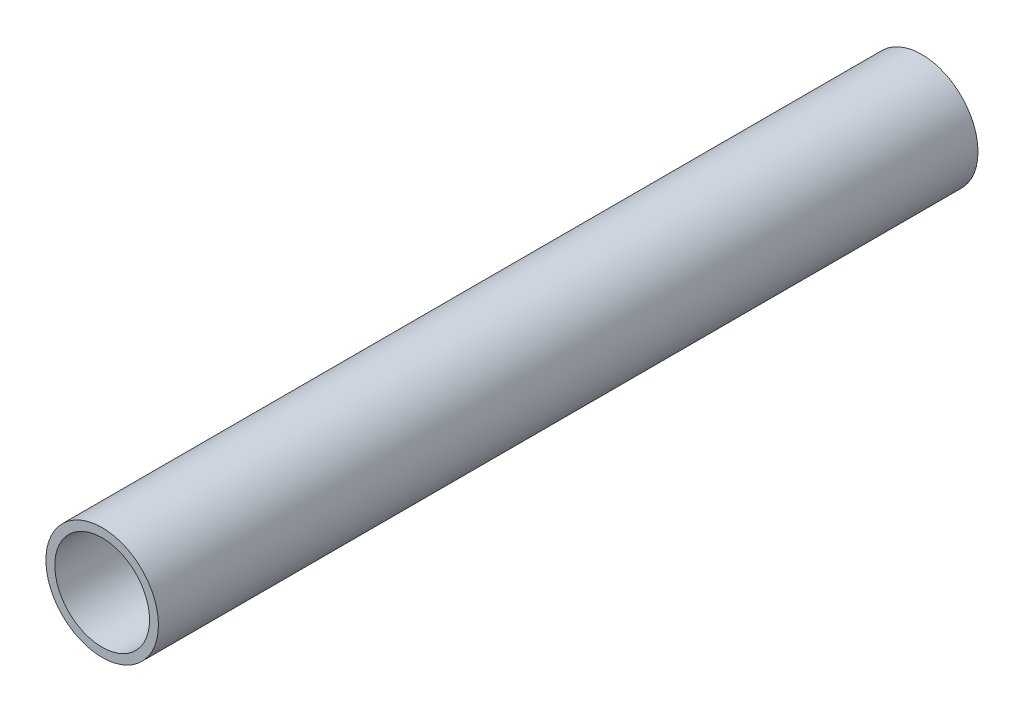
ISO-10303-21;
HEADER;
FILE_DESCRIPTION(('STEP AP214'),'2;1');
FILE_NAME('part.step','',(''),(''),'','','');
FILE_SCHEMA(('AUTOMOTIVE_DESIGN { 1 0 10303 214 1 1 1 1 }'));
ENDSEC;
DATA;
#1=APPLICATION_CONTEXT('core data for automotive mechanical design processes');
#2=APPLICATION_PROTOCOL_DEFINITION('international standard','automotive_design',2000,#1);
#3=PRODUCT_CONTEXT('',#1,'mechanical');
#4=PRODUCT('Part','Part','',(#3));
#5=PRODUCT_RELATED_PRODUCT_CATEGORY('part','',(#4));
#6=PRODUCT_DEFINITION_FORMATION('','',#4);
#7=PRODUCT_DEFINITION_CONTEXT('part definition',#1,'design');
#8=PRODUCT_DEFINITION('design','',#6,#7);
#9=PRODUCT_DEFINITION_SHAPE('','',#8);
#10=(LENGTH_UNIT() NAMED_UNIT(*) SI_UNIT(.MILLI.,.METRE.));
#11=(NAMED_UNIT(*) PLANE_ANGLE_UNIT() SI_UNIT($,.RADIAN.));
#12=(NAMED_UNIT(*) SI_UNIT($,.STERADIAN.) SOLID_ANGLE_UNIT());
#13=UNCERTAINTY_MEASURE_WITH_UNIT(LENGTH_MEASURE(1.E-05),#10,'distance_accuracy_value','');
#14=(GEOMETRIC_REPRESENTATION_CONTEXT(3) GLOBAL_UNCERTAINTY_ASSIGNED_CONTEXT((#13)) GLOBAL_UNIT_ASSIGNED_CONTEXT((#10,
#11,#12)) REPRESENTATION_CONTEXT('',''));
#15=CARTESIAN_POINT('',(0.,0.,0.));
#16=DIRECTION('',(0.,0.,1.));
#17=DIRECTION('',(1.,0.,0.));
#18=AXIS2_PLACEMENT_3D('',#15,#16,#17);
#19=CARTESIAN_POINT('',(0.,0.,-185.));
#20=DIRECTION('',(0.,0.,-1.));
#21=DIRECTION('',(1.,0.,0.));
#22=AXIS2_PLACEMENT_3D('',#19,#20,#21);
#23=PLANE('',#22);
#24=CARTESIAN_POINT('',(0.,0.,-185.));
#25=DIRECTION('',(0.,0.,1.));
#26=DIRECTION('',(1.,0.,0.));
#27=AXIS2_PLACEMENT_3D('',#24,#25,#26);
#28=CIRCLE('',#27,12.7);
#29=CARTESIAN_POINT('',(12.7,0.,-185.));
#30=VERTEX_POINT('',#29);
#31=EDGE_CURVE('E10',#30,#30,#28,.T.);
#32=ORIENTED_EDGE('',*,*,#31,.F.);
#33=EDGE_LOOP('',(#32));
#34=FACE_BOUND('',#33,.T.);
#35=CARTESIAN_POINT('',(0.,0.,-185.));
#36=DIRECTION('',(0.,0.,1.));
#37=DIRECTION('',(1.,0.,0.));
#38=AXIS2_PLACEMENT_3D('',#35,#36,#37);
#39=CIRCLE('',#38,10.7);
#40=CARTESIAN_POINT('',(10.7,0.,-185.));
#41=VERTEX_POINT('',#40);
#42=EDGE_CURVE('E48',#41,#41,#39,.T.);
#43=ORIENTED_EDGE('',*,*,#42,.T.);
#44=EDGE_LOOP('',(#43));
#45=FACE_BOUND('',#44,.T.);
#46=ADVANCED_FACE('F37',(#34,#45),#23,.T.);
#47=CARTESIAN_POINT('',(0.,0.,0.));
#48=DIRECTION('',(0.,0.,-1.));
#49=DIRECTION('',(1.,0.,0.));
#50=AXIS2_PLACEMENT_3D('',#47,#48,#49);
#51=PLANE('',#50);
#52=CARTESIAN_POINT('',(0.,0.,0.));
#53=DIRECTION('',(0.,0.,1.));
#54=DIRECTION('',(1.,0.,0.));
#55=AXIS2_PLACEMENT_3D('',#52,#53,#54);
#56=CIRCLE('',#55,12.7);
#57=CARTESIAN_POINT('',(12.7,0.,0.));
#58=VERTEX_POINT('',#57);
#59=EDGE_CURVE('E41',#58,#58,#56,.T.);
#60=ORIENTED_EDGE('',*,*,#59,.T.);
#61=EDGE_LOOP('',(#60));
#62=FACE_BOUND('',#61,.T.);
#63=CARTESIAN_POINT('',(0.,0.,0.));
#64=DIRECTION('',(0.,0.,1.));
#65=DIRECTION('',(1.,0.,0.));
#66=AXIS2_PLACEMENT_3D('',#63,#64,#65);
#67=CIRCLE('',#66,10.7);
#68=CARTESIAN_POINT('',(10.7,0.,0.));
#69=VERTEX_POINT('',#68);
#70=EDGE_CURVE('E50',#69,#69,#67,.T.);
#71=ORIENTED_EDGE('',*,*,#70,.F.);
#72=EDGE_LOOP('',(#71));
#73=FACE_BOUND('',#72,.T.);
#74=ADVANCED_FACE('F63',(#62,#73),#51,.F.);
#75=CARTESIAN_POINT('',(0.,0.,-185.));
#76=DIRECTION('',(0.,0.,1.));
#77=DIRECTION('',(-1.,0.,0.));
#78=AXIS2_PLACEMENT_3D('',#75,#76,#77);
#79=CYLINDRICAL_SURFACE('',#78,12.7);
#80=ORIENTED_EDGE('',*,*,#31,.T.);
#81=EDGE_LOOP('',(#80));
#82=FACE_BOUND('',#81,.T.);
#83=ORIENTED_EDGE('',*,*,#59,.F.);
#84=EDGE_LOOP('',(#83));
#85=FACE_BOUND('',#84,.T.);
#86=ADVANCED_FACE('F39',(#82,#85),#79,.T.);
#87=CARTESIAN_POINT('',(0.,0.,-185.));
#88=DIRECTION('',(0.,0.,1.));
#89=DIRECTION('',(-1.,0.,0.));
#90=AXIS2_PLACEMENT_3D('',#87,#88,#89);
#91=CYLINDRICAL_SURFACE('',#90,10.7);
#92=ORIENTED_EDGE('',*,*,#42,.F.);
#93=EDGE_LOOP('',(#92));
#94=FACE_BOUND('',#93,.T.);
#95=ORIENTED_EDGE('',*,*,#70,.T.);
#96=EDGE_LOOP('',(#95));
#97=FACE_BOUND('',#96,.T.);
#98=ADVANCED_FACE('F57',(#94,#97),#91,.F.);
#99=CLOSED_SHELL('',(#46,#74,#86,#98));
#100=MANIFOLD_SOLID_BREP('B2',#99);
#101=ADVANCED_BREP_SHAPE_REPRESENTATION('',(#18,#100),#14);
#102=SHAPE_DEFINITION_REPRESENTATION(#9,#101);
ENDSEC;
END-ISO-10303-21;
